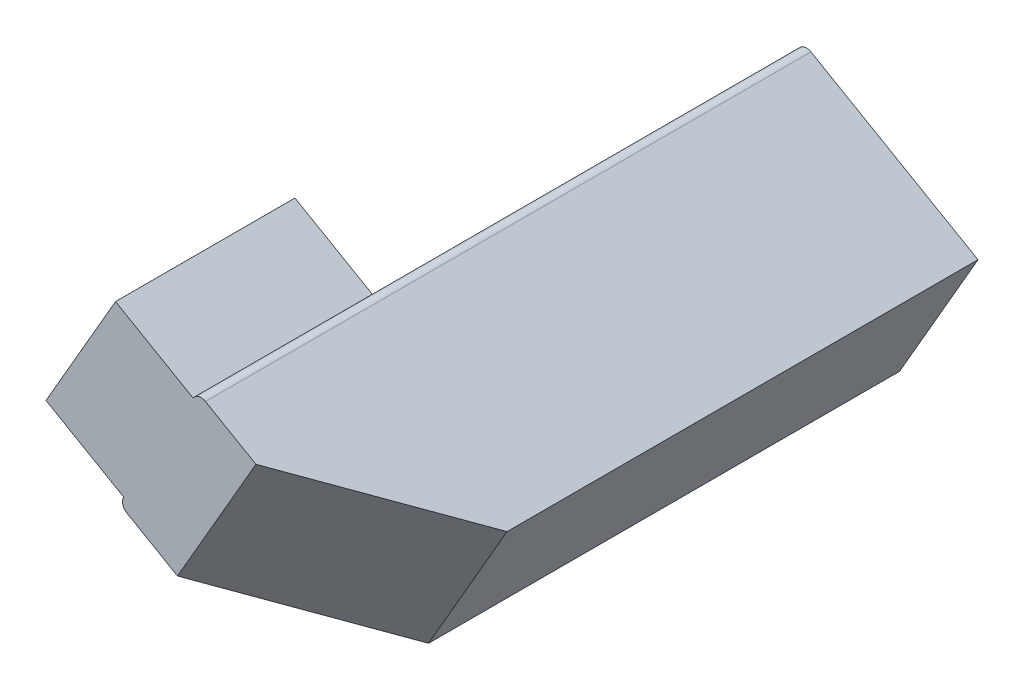
ISO-10303-21;
HEADER;
FILE_DESCRIPTION(('STEP AP214'),'2;1');
FILE_NAME('part.step','',(''),(''),'','','');
FILE_SCHEMA(('AUTOMOTIVE_DESIGN { 1 0 10303 214 1 1 1 1 }'));
ENDSEC;
DATA;
#1=APPLICATION_CONTEXT('core data for automotive mechanical design processes');
#2=APPLICATION_PROTOCOL_DEFINITION('international standard','automotive_design',2000,#1);
#3=PRODUCT_CONTEXT('',#1,'mechanical');
#4=PRODUCT('Part','Part','',(#3));
#5=PRODUCT_RELATED_PRODUCT_CATEGORY('part','',(#4));
#6=PRODUCT_DEFINITION_FORMATION('','',#4);
#7=PRODUCT_DEFINITION_CONTEXT('part definition',#1,'design');
#8=PRODUCT_DEFINITION('design','',#6,#7);
#9=PRODUCT_DEFINITION_SHAPE('','',#8);
#10=(LENGTH_UNIT() NAMED_UNIT(*) SI_UNIT(.MILLI.,.METRE.));
#11=(NAMED_UNIT(*) PLANE_ANGLE_UNIT() SI_UNIT($,.RADIAN.));
#12=(NAMED_UNIT(*) SI_UNIT($,.STERADIAN.) SOLID_ANGLE_UNIT());
#13=UNCERTAINTY_MEASURE_WITH_UNIT(LENGTH_MEASURE(1.E-05),#10,'distance_accuracy_value','');
#14=(GEOMETRIC_REPRESENTATION_CONTEXT(3) GLOBAL_UNCERTAINTY_ASSIGNED_CONTEXT((#13)) GLOBAL_UNIT_ASSIGNED_CONTEXT((#10,
#11,#12)) REPRESENTATION_CONTEXT('',''));
#15=CARTESIAN_POINT('',(0.,0.,0.));
#16=DIRECTION('',(0.,0.,1.));
#17=DIRECTION('',(1.,0.,0.));
#18=AXIS2_PLACEMENT_3D('',#15,#16,#17);
#19=CARTESIAN_POINT('',(74.86696879329,-25.3266062413411,135.));
#20=DIRECTION('',(0.866025403784444,-0.499999999999991,0.));
#21=DIRECTION('',(0.499999999999991,0.866025403784444,0.));
#22=AXIS2_PLACEMENT_3D('',#19,#20,#21);
#23=PLANE('',#22);
#24=DIRECTION('',(-0.499999999999991,-0.866025403784444,0.));
#25=VECTOR('',#24,1.);
#26=CARTESIAN_POINT('',(59.3669687932903,-52.1733937586588,95.));
#27=LINE('',#26,#25);
#28=CARTESIAN_POINT('',(74.86696879329,-25.3266062413411,95.));
#29=VERTEX_POINT('',#28);
#30=CARTESIAN_POINT('',(59.3669687932903,-52.1733937586588,95.));
#31=VERTEX_POINT('',#30);
#32=EDGE_CURVE('E141',#29,#31,#27,.T.);
#33=ORIENTED_EDGE('',*,*,#32,.F.);
#34=DIRECTION('',(0.,0.,-1.));
#35=VECTOR('',#34,1.);
#36=CARTESIAN_POINT('',(74.86696879329,-25.3266062413411,135.));
#37=LINE('',#36,#35);
#38=CARTESIAN_POINT('',(74.86696879329,-25.3266062413411,0.));
#39=VERTEX_POINT('',#38);
#40=EDGE_CURVE('E202',#29,#39,#37,.T.);
#41=ORIENTED_EDGE('',*,*,#40,.T.);
#42=DIRECTION('',(-0.499999999999991,-0.866025403784444,0.));
#43=VECTOR('',#42,1.);
#44=CARTESIAN_POINT('',(74.86696879329,-25.3266062413411,0.));
#45=LINE('',#44,#43);
#46=CARTESIAN_POINT('',(59.3669687932903,-52.1733937586588,0.));
#47=VERTEX_POINT('',#46);
#48=EDGE_CURVE('E181',#39,#47,#45,.T.);
#49=ORIENTED_EDGE('',*,*,#48,.T.);
#50=DIRECTION('',(0.,0.,-1.));
#51=VECTOR('',#50,1.);
#52=CARTESIAN_POINT('',(59.3669687932903,-52.1733937586588,135.));
#53=LINE('',#52,#51);
#54=EDGE_CURVE('E197',#31,#47,#53,.T.);
#55=ORIENTED_EDGE('',*,*,#54,.F.);
#56=EDGE_LOOP('',(#33,#41,#49,#55));
#57=FACE_BOUND('',#56,.T.);
#58=ADVANCED_FACE('F44',(#57),#23,.F.);
#59=CARTESIAN_POINT('',(97.33811196359,-76.4054445662277,135.));
#60=DIRECTION('',(-0.866025403784439,0.5,0.));
#61=DIRECTION('',(-0.5,-0.866025403784439,0.));
#62=AXIS2_PLACEMENT_3D('',#59,#60,#61);
#63=PLANE('',#62);
#64=DIRECTION('',(0.,0.,-1.));
#65=VECTOR('',#64,1.);
#66=CARTESIAN_POINT('',(114.83811196359,-46.0945554337723,135.));
#67=LINE('',#66,#65);
#68=CARTESIAN_POINT('',(114.83811196359,-46.0945554337723,105.));
#69=VERTEX_POINT('',#68);
#70=CARTESIAN_POINT('',(114.83811196359,-46.0945554337723,0.));
#71=VERTEX_POINT('',#70);
#72=EDGE_CURVE('E209',#69,#71,#67,.T.);
#73=ORIENTED_EDGE('',*,*,#72,.F.);
#74=DIRECTION('',(-0.5,-0.866025403784439,0.));
#75=VECTOR('',#74,1.);
#76=CARTESIAN_POINT('',(97.33811196359,-76.4054445662277,105.));
#77=LINE('',#76,#75);
#78=CARTESIAN_POINT('',(97.33811196359,-76.4054445662277,105.));
#79=VERTEX_POINT('',#78);
#80=EDGE_CURVE('E54',#69,#79,#77,.T.);
#81=ORIENTED_EDGE('',*,*,#80,.T.);
#82=DIRECTION('',(0.,0.,-1.));
#83=VECTOR('',#82,1.);
#84=CARTESIAN_POINT('',(97.33811196359,-76.4054445662277,135.));
#85=LINE('',#84,#83);
#86=CARTESIAN_POINT('',(97.33811196359,-76.4054445662277,0.));
#87=VERTEX_POINT('',#86);
#88=EDGE_CURVE('E173',#79,#87,#85,.T.);
#89=ORIENTED_EDGE('',*,*,#88,.T.);
#90=DIRECTION('',(0.5,0.866025403784439,0.));
#91=VECTOR('',#90,1.);
#92=CARTESIAN_POINT('',(97.33811196359,-76.4054445662277,0.));
#93=LINE('',#92,#91);
#94=EDGE_CURVE('E148',#87,#71,#93,.T.);
#95=ORIENTED_EDGE('',*,*,#94,.T.);
#96=EDGE_LOOP('',(#73,#81,#89,#95));
#97=FACE_BOUND('',#96,.T.);
#98=ADVANCED_FACE('F260',(#97),#63,.F.);
#99=CARTESIAN_POINT('',(114.83811196359,-46.0945554337723,135.));
#100=DIRECTION('',(-0.5,-0.866025403784439,0.));
#101=DIRECTION('',(0.866025403784439,-0.5,0.));
#102=AXIS2_PLACEMENT_3D('',#99,#100,#101);
#103=PLANE('',#102);
#104=DIRECTION('',(-0.866025403784439,0.5,0.));
#105=VECTOR('',#104,1.);
#106=CARTESIAN_POINT('',(114.83811196359,-46.0945554337723,135.));
#107=LINE('',#106,#105);
#108=CARTESIAN_POINT('',(88.8573498500568,-31.0945554337723,135.));
#109=VERTEX_POINT('',#108);
#110=CARTESIAN_POINT('',(77.5990196008591,-24.5945554337723,135.));
#111=VERTEX_POINT('',#110);
#112=EDGE_CURVE('E159',#109,#111,#107,.T.);
#113=ORIENTED_EDGE('',*,*,#112,.F.);
#114=DIRECTION('',(0.612372435695793,-0.353553390593273,-0.707106781186549));
#115=VECTOR('',#114,1.);
#116=CARTESIAN_POINT('',(88.8573498500568,-31.0945554337723,135.));
#117=LINE('',#116,#115);
#118=EDGE_CURVE('E68',#109,#69,#117,.T.);
#119=ORIENTED_EDGE('',*,*,#118,.T.);
#120=ORIENTED_EDGE('',*,*,#72,.T.);
#121=DIRECTION('',(-0.866025403784439,0.5,0.));
#122=VECTOR('',#121,1.);
#123=CARTESIAN_POINT('',(114.83811196359,-46.0945554337723,0.));
#124=LINE('',#123,#122);
#125=CARTESIAN_POINT('',(77.5990196008591,-24.5945554337723,0.));
#126=VERTEX_POINT('',#125);
#127=EDGE_CURVE('E153',#71,#126,#124,.T.);
#128=ORIENTED_EDGE('',*,*,#127,.T.);
#129=DIRECTION('',(0.,0.,-1.));
#130=VECTOR('',#129,1.);
#131=CARTESIAN_POINT('',(77.5990196008591,-24.5945554337723,135.));
#132=LINE('',#131,#130);
#133=EDGE_CURVE('E205',#111,#126,#132,.T.);
#134=ORIENTED_EDGE('',*,*,#133,.F.);
#135=EDGE_LOOP('',(#113,#119,#120,#128,#134));
#136=FACE_BOUND('',#135,.T.);
#137=ADVANCED_FACE('F262',(#136),#103,.F.);
#138=CARTESIAN_POINT('',(76.599019600859,-26.3266062413415,135.));
#139=DIRECTION('',(0.,0.,-1.));
#140=DIRECTION('',(-1.,0.,0.));
#141=AXIS2_PLACEMENT_3D('',#138,#139,#140);
#142=CYLINDRICAL_SURFACE('',#141,2.0000000000003);
#143=CARTESIAN_POINT('',(76.599019600859,-26.3266062413415,0.));
#144=DIRECTION('',(0.,0.,1.));
#145=DIRECTION('',(1.,0.,0.));
#146=AXIS2_PLACEMENT_3D('',#143,#144,#145);
#147=CIRCLE('',#146,2.0000000000003);
#148=EDGE_CURVE('E177',#126,#39,#147,.T.);
#149=ORIENTED_EDGE('',*,*,#148,.T.);
#150=ORIENTED_EDGE('',*,*,#40,.F.);
#151=CARTESIAN_POINT('',(74.86696879329,-25.3266062413411,135.));
#152=VERTEX_POINT('',#151);
#153=EDGE_CURVE('E145',#152,#29,#37,.T.);
#154=ORIENTED_EDGE('',*,*,#153,.F.);
#155=CARTESIAN_POINT('',(76.599019600859,-26.3266062413415,135.));
#156=DIRECTION('',(0.,0.,1.));
#157=DIRECTION('',(1.,0.,0.));
#158=AXIS2_PLACEMENT_3D('',#155,#156,#157);
#159=CIRCLE('',#158,2.0000000000003);
#160=EDGE_CURVE('E162',#111,#152,#159,.T.);
#161=ORIENTED_EDGE('',*,*,#160,.F.);
#162=ORIENTED_EDGE('',*,*,#133,.T.);
#163=EDGE_LOOP('',(#149,#150,#154,#161,#162));
#164=FACE_BOUND('',#163,.T.);
#165=ADVANCED_FACE('F259',(#164),#142,.T.);
#166=CARTESIAN_POINT('',(61.0990196008593,-53.1733937586585,135.));
#167=DIRECTION('',(0.,0.,-1.));
#168=DIRECTION('',(-1.,0.,0.));
#169=AXIS2_PLACEMENT_3D('',#166,#167,#168);
#170=CYLINDRICAL_SURFACE('',#169,2.00000000000008);
#171=CARTESIAN_POINT('',(61.0990196008593,-53.1733937586585,0.));
#172=DIRECTION('',(0.,0.,1.));
#173=DIRECTION('',(1.,0.,0.));
#174=AXIS2_PLACEMENT_3D('',#171,#172,#173);
#175=CIRCLE('',#174,2.00000000000008);
#176=CARTESIAN_POINT('',(60.0990196008593,-54.9054445662275,0.));
#177=VERTEX_POINT('',#176);
#178=EDGE_CURVE('E185',#47,#177,#175,.T.);
#179=ORIENTED_EDGE('',*,*,#178,.T.);
#180=DIRECTION('',(0.,0.,-1.));
#181=VECTOR('',#180,1.);
#182=CARTESIAN_POINT('',(60.0990196008593,-54.9054445662275,135.));
#183=LINE('',#182,#181);
#184=CARTESIAN_POINT('',(60.0990196008593,-54.9054445662275,135.));
#185=VERTEX_POINT('',#184);
#186=EDGE_CURVE('E193',#185,#177,#183,.T.);
#187=ORIENTED_EDGE('',*,*,#186,.F.);
#188=CARTESIAN_POINT('',(61.0990196008593,-53.1733937586585,135.));
#189=DIRECTION('',(0.,0.,1.));
#190=DIRECTION('',(1.,0.,0.));
#191=AXIS2_PLACEMENT_3D('',#188,#189,#190);
#192=CIRCLE('',#191,2.00000000000008);
#193=CARTESIAN_POINT('',(59.3669687932903,-52.1733937586588,135.));
#194=VERTEX_POINT('',#193);
#195=EDGE_CURVE('E167',#194,#185,#192,.T.);
#196=ORIENTED_EDGE('',*,*,#195,.F.);
#197=EDGE_CURVE('E198',#194,#31,#53,.T.);
#198=ORIENTED_EDGE('',*,*,#197,.T.);
#199=ORIENTED_EDGE('',*,*,#54,.T.);
#200=EDGE_LOOP('',(#179,#187,#196,#198,#199));
#201=FACE_BOUND('',#200,.T.);
#202=ADVANCED_FACE('F222',(#201),#170,.T.);
#203=CARTESIAN_POINT('',(60.0990196008592,-54.9054445662276,135.));
#204=DIRECTION('',(0.500000000000003,0.866025403784437,0.));
#205=DIRECTION('',(-0.866025403784437,0.500000000000003,0.));
#206=AXIS2_PLACEMENT_3D('',#203,#204,#205);
#207=PLANE('',#206);
#208=ORIENTED_EDGE('',*,*,#88,.F.);
#209=DIRECTION('',(-0.612372435695792,0.353553390593275,0.707106781186549));
#210=VECTOR('',#209,1.);
#211=CARTESIAN_POINT('',(71.3573498500568,-61.4054445662276,135.));
#212=LINE('',#211,#210);
#213=CARTESIAN_POINT('',(71.3573498500569,-61.4054445662276,135.));
#214=VERTEX_POINT('',#213);
#215=EDGE_CURVE('E11',#79,#214,#212,.T.);
#216=ORIENTED_EDGE('',*,*,#215,.T.);
#217=DIRECTION('',(0.866025403784437,-0.500000000000003,0.));
#218=VECTOR('',#217,1.);
#219=CARTESIAN_POINT('',(60.0990196008592,-54.9054445662276,135.));
#220=LINE('',#219,#218);
#221=EDGE_CURVE('E170',#185,#214,#220,.T.);
#222=ORIENTED_EDGE('',*,*,#221,.F.);
#223=ORIENTED_EDGE('',*,*,#186,.T.);
#224=DIRECTION('',(0.866025403784437,-0.500000000000003,0.));
#225=VECTOR('',#224,1.);
#226=CARTESIAN_POINT('',(60.0990196008592,-54.9054445662276,0.));
#227=LINE('',#226,#225);
#228=EDGE_CURVE('E163',#177,#87,#227,.T.);
#229=ORIENTED_EDGE('',*,*,#228,.T.);
#230=EDGE_LOOP('',(#208,#216,#222,#223,#229));
#231=FACE_BOUND('',#230,.T.);
#232=ADVANCED_FACE('F237',(#231),#207,.F.);
#233=CARTESIAN_POINT('',(76.599019600859,-26.3266062413415,135.));
#234=DIRECTION('',(0.,0.,1.));
#235=DIRECTION('',(1.,0.,0.));
#236=AXIS2_PLACEMENT_3D('',#233,#234,#235);
#237=PLANE('',#236);
#238=ORIENTED_EDGE('',*,*,#221,.T.);
#239=DIRECTION('',(0.5,0.866025403784439,0.));
#240=VECTOR('',#239,1.);
#241=CARTESIAN_POINT('',(88.8573498500568,-31.0945554337723,135.));
#242=LINE('',#241,#240);
#243=EDGE_CURVE('E212',#214,#109,#242,.T.);
#244=ORIENTED_EDGE('',*,*,#243,.T.);
#245=ORIENTED_EDGE('',*,*,#112,.T.);
#246=ORIENTED_EDGE('',*,*,#160,.T.);
#247=DIRECTION('',(0.866025403784444,-0.499999999999991,0.));
#248=VECTOR('',#247,1.);
#249=CARTESIAN_POINT('',(57.5464607176011,-15.3266062413412,135.));
#250=LINE('',#249,#248);
#251=CARTESIAN_POINT('',(57.5464607176011,-15.3266062413412,135.));
#252=VERTEX_POINT('',#251);
#253=EDGE_CURVE('E246',#252,#152,#250,.T.);
#254=ORIENTED_EDGE('',*,*,#253,.F.);
#255=DIRECTION('',(0.499999999999991,0.866025403784444,0.));
#256=VECTOR('',#255,1.);
#257=CARTESIAN_POINT('',(57.5464607176011,-15.3266062413412,135.));
#258=LINE('',#257,#256);
#259=CARTESIAN_POINT('',(42.0464607176014,-42.173393758659,135.));
#260=VERTEX_POINT('',#259);
#261=EDGE_CURVE('E137',#260,#252,#258,.T.);
#262=ORIENTED_EDGE('',*,*,#261,.F.);
#263=DIRECTION('',(0.866025403784444,-0.499999999999991,0.));
#264=VECTOR('',#263,1.);
#265=CARTESIAN_POINT('',(42.0464607176014,-42.173393758659,135.));
#266=LINE('',#265,#264);
#267=EDGE_CURVE('E155',#260,#194,#266,.T.);
#268=ORIENTED_EDGE('',*,*,#267,.T.);
#269=ORIENTED_EDGE('',*,*,#195,.T.);
#270=EDGE_LOOP('',(#238,#244,#245,#246,#254,#262,#268,#269));
#271=FACE_BOUND('',#270,.T.);
#272=ADVANCED_FACE('F241',(#271),#237,.T.);
#273=CARTESIAN_POINT('',(76.599019600859,-26.3266062413415,0.));
#274=DIRECTION('',(0.,0.,1.));
#275=DIRECTION('',(1.,0.,0.));
#276=AXIS2_PLACEMENT_3D('',#273,#274,#275);
#277=PLANE('',#276);
#278=ORIENTED_EDGE('',*,*,#94,.F.);
#279=ORIENTED_EDGE('',*,*,#228,.F.);
#280=ORIENTED_EDGE('',*,*,#178,.F.);
#281=ORIENTED_EDGE('',*,*,#48,.F.);
#282=ORIENTED_EDGE('',*,*,#148,.F.);
#283=ORIENTED_EDGE('',*,*,#127,.F.);
#284=EDGE_LOOP('',(#278,#279,#280,#281,#282,#283));
#285=FACE_BOUND('',#284,.T.);
#286=ADVANCED_FACE('F234',(#285),#277,.F.);
#287=CARTESIAN_POINT('',(57.5464607176011,-15.3266062413412,95.));
#288=DIRECTION('',(-0.499999999999991,-0.866025403784444,0.));
#289=DIRECTION('',(0.866025403784444,-0.499999999999991,0.));
#290=AXIS2_PLACEMENT_3D('',#287,#288,#289);
#291=PLANE('',#290);
#292=ORIENTED_EDGE('',*,*,#153,.T.);
#293=DIRECTION('',(0.866025403784444,-0.499999999999991,0.));
#294=VECTOR('',#293,1.);
#295=CARTESIAN_POINT('',(57.5464607176011,-15.3266062413412,95.));
#296=LINE('',#295,#294);
#297=CARTESIAN_POINT('',(57.5464607176011,-15.3266062413412,95.));
#298=VERTEX_POINT('',#297);
#299=EDGE_CURVE('E124',#298,#29,#296,.T.);
#300=ORIENTED_EDGE('',*,*,#299,.F.);
#301=DIRECTION('',(0.,0.,-1.));
#302=VECTOR('',#301,1.);
#303=CARTESIAN_POINT('',(57.5464607176011,-15.3266062413412,95.));
#304=LINE('',#303,#302);
#305=EDGE_CURVE('E132',#252,#298,#304,.T.);
#306=ORIENTED_EDGE('',*,*,#305,.F.);
#307=ORIENTED_EDGE('',*,*,#253,.T.);
#308=EDGE_LOOP('',(#292,#300,#306,#307));
#309=FACE_BOUND('',#308,.T.);
#310=ADVANCED_FACE('F143',(#309),#291,.F.);
#311=CARTESIAN_POINT('',(42.0464607176014,-42.173393758659,95.));
#312=DIRECTION('',(0.,0.,1.));
#313=DIRECTION('',(1.,0.,0.));
#314=AXIS2_PLACEMENT_3D('',#311,#312,#313);
#315=PLANE('',#314);
#316=ORIENTED_EDGE('',*,*,#32,.T.);
#317=DIRECTION('',(0.866025403784444,-0.499999999999991,0.));
#318=VECTOR('',#317,1.);
#319=CARTESIAN_POINT('',(42.0464607176014,-42.173393758659,95.));
#320=LINE('',#319,#318);
#321=CARTESIAN_POINT('',(42.0464607176014,-42.173393758659,95.));
#322=VERTEX_POINT('',#321);
#323=EDGE_CURVE('E127',#322,#31,#320,.T.);
#324=ORIENTED_EDGE('',*,*,#323,.F.);
#325=DIRECTION('',(-0.499999999999991,-0.866025403784444,0.));
#326=VECTOR('',#325,1.);
#327=CARTESIAN_POINT('',(42.0464607176014,-42.173393758659,95.));
#328=LINE('',#327,#326);
#329=EDGE_CURVE('E120',#298,#322,#328,.T.);
#330=ORIENTED_EDGE('',*,*,#329,.F.);
#331=ORIENTED_EDGE('',*,*,#299,.T.);
#332=EDGE_LOOP('',(#316,#324,#330,#331));
#333=FACE_BOUND('',#332,.T.);
#334=ADVANCED_FACE('F122',(#333),#315,.F.);
#335=CARTESIAN_POINT('',(42.0464607176014,-42.173393758659,135.));
#336=DIRECTION('',(0.499999999999991,0.866025403784444,0.));
#337=DIRECTION('',(-0.866025403784444,0.499999999999991,0.));
#338=AXIS2_PLACEMENT_3D('',#335,#336,#337);
#339=PLANE('',#338);
#340=ORIENTED_EDGE('',*,*,#197,.F.);
#341=ORIENTED_EDGE('',*,*,#267,.F.);
#342=DIRECTION('',(0.,0.,1.));
#343=VECTOR('',#342,1.);
#344=CARTESIAN_POINT('',(42.0464607176014,-42.173393758659,135.));
#345=LINE('',#344,#343);
#346=EDGE_CURVE('E131',#322,#260,#345,.T.);
#347=ORIENTED_EDGE('',*,*,#346,.F.);
#348=ORIENTED_EDGE('',*,*,#323,.T.);
#349=EDGE_LOOP('',(#340,#341,#347,#348));
#350=FACE_BOUND('',#349,.T.);
#351=ADVANCED_FACE('F247',(#350),#339,.F.);
#352=CARTESIAN_POINT('',(49.7964607176026,-28.7499999999978,0.));
#353=DIRECTION('',(0.866025403784444,-0.499999999999991,0.));
#354=DIRECTION('',(0.499999999999991,0.866025403784444,0.));
#355=AXIS2_PLACEMENT_3D('',#352,#353,#354);
#356=PLANE('',#355);
#357=ORIENTED_EDGE('',*,*,#305,.T.);
#358=ORIENTED_EDGE('',*,*,#329,.T.);
#359=ORIENTED_EDGE('',*,*,#346,.T.);
#360=ORIENTED_EDGE('',*,*,#261,.T.);
#361=EDGE_LOOP('',(#357,#358,#359,#360));
#362=FACE_BOUND('',#361,.T.);
#363=ADVANCED_FACE('F135',(#362),#356,.F.);
#364=CARTESIAN_POINT('',(87.8573498500567,-32.8266062413415,135.));
#365=DIRECTION('',(0.612372435695796,-0.353553390593274,0.707106781186546));
#366=DIRECTION('',(-0.5,-0.866025403784439,0.));
#367=AXIS2_PLACEMENT_3D('',#364,#365,#366);
#368=PLANE('',#367);
#369=ORIENTED_EDGE('',*,*,#215,.F.);
#370=ORIENTED_EDGE('',*,*,#80,.F.);
#371=ORIENTED_EDGE('',*,*,#118,.F.);
#372=ORIENTED_EDGE('',*,*,#243,.F.);
#373=EDGE_LOOP('',(#369,#370,#371,#372));
#374=FACE_BOUND('',#373,.T.);
#375=ADVANCED_FACE('F47',(#374),#368,.T.);
#376=CLOSED_SHELL('',(#58,#98,#137,#165,#202,#232,#272,#286,#310,#334,#351,#363,#375));
#377=MANIFOLD_SOLID_BREP('B2',#376);
#378=ADVANCED_BREP_SHAPE_REPRESENTATION('',(#18,#377),#14);
#379=SHAPE_DEFINITION_REPRESENTATION(#9,#378);
ENDSEC;
END-ISO-10303-21;
